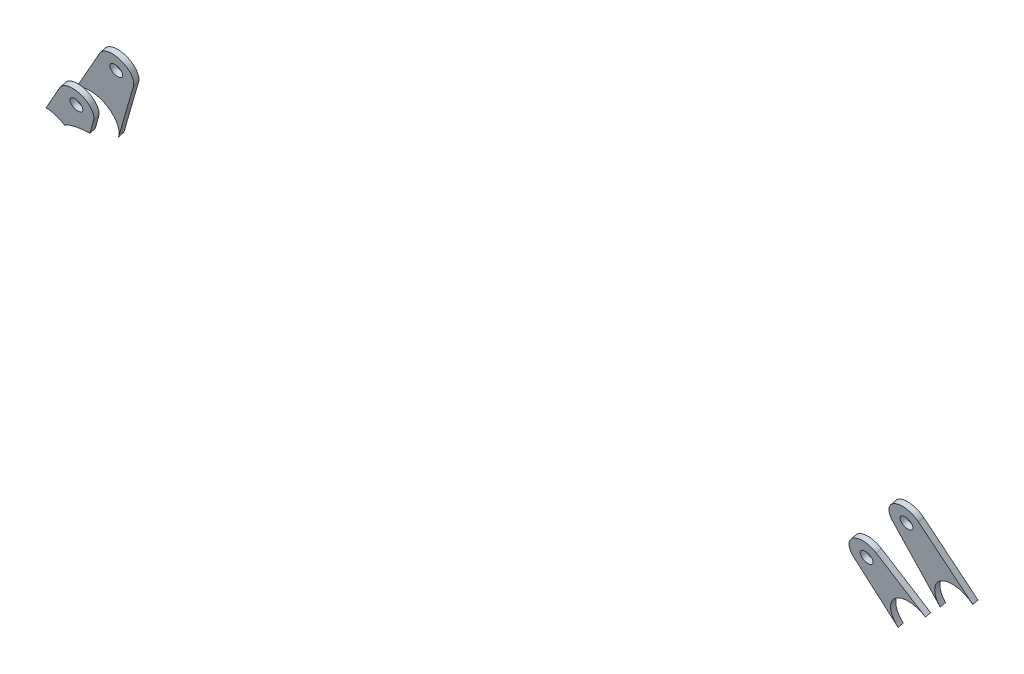
ISO-10303-21;
HEADER;
FILE_DESCRIPTION(('STEP AP214'),'2;1');
FILE_NAME('part.step','',(''),(''),'','','');
FILE_SCHEMA(('AUTOMOTIVE_DESIGN { 1 0 10303 214 1 1 1 1 }'));
ENDSEC;
DATA;
#1=APPLICATION_CONTEXT('core data for automotive mechanical design processes');
#2=APPLICATION_PROTOCOL_DEFINITION('international standard','automotive_design',2000,#1);
#3=PRODUCT_CONTEXT('',#1,'mechanical');
#4=PRODUCT('Part','Part','',(#3));
#5=PRODUCT_RELATED_PRODUCT_CATEGORY('part','',(#4));
#6=PRODUCT_DEFINITION_FORMATION('','',#4);
#7=PRODUCT_DEFINITION_CONTEXT('part definition',#1,'design');
#8=PRODUCT_DEFINITION('design','',#6,#7);
#9=PRODUCT_DEFINITION_SHAPE('','',#8);
#10=(LENGTH_UNIT() NAMED_UNIT(*) SI_UNIT(.MILLI.,.METRE.));
#11=(NAMED_UNIT(*) PLANE_ANGLE_UNIT() SI_UNIT($,.RADIAN.));
#12=(NAMED_UNIT(*) SI_UNIT($,.STERADIAN.) SOLID_ANGLE_UNIT());
#13=UNCERTAINTY_MEASURE_WITH_UNIT(LENGTH_MEASURE(1.E-05),#10,'distance_accuracy_value','');
#14=(GEOMETRIC_REPRESENTATION_CONTEXT(3) GLOBAL_UNCERTAINTY_ASSIGNED_CONTEXT((#13)) GLOBAL_UNIT_ASSIGNED_CONTEXT((#10,
#11,#12)) REPRESENTATION_CONTEXT('',''));
#15=CARTESIAN_POINT('',(0.,0.,0.));
#16=DIRECTION('',(0.,0.,1.));
#17=DIRECTION('',(1.,0.,0.));
#18=AXIS2_PLACEMENT_3D('',#15,#16,#17);
#19=CARTESIAN_POINT('',(-323.618752944138,84.6346554572961,266.700501514992));
#20=DIRECTION('',(0.912699556863011,-0.396326961660261,-0.0995211453069603));
#21=DIRECTION('',(0.398304364618356,0.917253309138739,0.));
#22=AXIS2_PLACEMENT_3D('',#19,#20,#21);
#23=PLANE('',#22);
#24=DIRECTION('',(0.408617382826522,0.887195361637097,0.214280714814993));
#25=VECTOR('',#24,1.);
#26=CARTESIAN_POINT('',(-323.60864452257,83.9259355071346,269.615568212695));
#27=LINE('',#26,#25);
#28=CARTESIAN_POINT('',(-255.599003552041,231.589350113444,305.280116746263));
#29=VERTEX_POINT('',#28);
#30=CARTESIAN_POINT('',(-251.285551049687,240.954774134955,307.54210980963));
#31=VERTEX_POINT('',#30);
#32=EDGE_CURVE('E138',#29,#31,#27,.T.);
#33=ORIENTED_EDGE('',*,*,#32,.F.);
#34=DIRECTION('',(0.00336947385613183,-0.236239983387161,0.9716888992343));
#35=VECTOR('',#34,1.);
#36=CARTESIAN_POINT('',(-255.609111973609,232.298070063605,302.36505004856));
#37=LINE('',#36,#35);
#38=CARTESIAN_POINT('',(-255.609111973609,232.298070063605,302.36505004856));
#39=VERTEX_POINT('',#38);
#40=EDGE_CURVE('E12',#39,#29,#37,.T.);
#41=ORIENTED_EDGE('',*,*,#40,.F.);
#42=DIRECTION('',(0.408617382826522,0.887195361637097,0.214280714814993));
#43=VECTOR('',#42,1.);
#44=CARTESIAN_POINT('',(-323.618752944138,84.6346554572961,266.700501514992));
#45=LINE('',#44,#43);
#46=CARTESIAN_POINT('',(-251.295659471255,241.663494085116,304.627043111927));
#47=VERTEX_POINT('',#46);
#48=EDGE_CURVE('E170',#39,#47,#45,.T.);
#49=ORIENTED_EDGE('',*,*,#48,.T.);
#50=DIRECTION('',(0.00336947385613183,-0.236239983387161,0.9716888992343));
#51=VECTOR('',#50,1.);
#52=CARTESIAN_POINT('',(-251.295659471255,241.663494085116,304.627043111927));
#53=LINE('',#52,#51);
#54=EDGE_CURVE('E89',#47,#31,#53,.T.);
#55=ORIENTED_EDGE('',*,*,#54,.T.);
#56=EDGE_LOOP('',(#33,#41,#49,#55));
#57=FACE_BOUND('',#56,.T.);
#58=ADVANCED_FACE('F47',(#57),#23,.T.);
#59=CARTESIAN_POINT('',(-267.768306548203,216.515355784536,298.57007197094));
#60=CARTESIAN_POINT('',(-244.725102094374,199.337784130967,294.313902408543));
#61=CARTESIAN_POINT('',(-204.568474804515,198.7676940574,294.03605136432));
#62=CARTESIAN_POINT('',(-208.929507414764,215.680041227753,298.162955564922));
#63=CARTESIAN_POINT('',(-213.290540025014,232.592388398106,302.289859765523));
#64=CARTESIAN_POINT('',(-255.476061824664,241.030653600877,304.487681152403));
#65=CARTESIAN_POINT('',(-270.741108911879,228.044062431943,301.383275094755));
#66=(BOUNDED_CURVE() B_SPLINE_CURVE(3,(#59,#60,#61,#62,#63,#64,#65),.UNSPECIFIED.,.F.,
.F.) B_SPLINE_CURVE_WITH_KNOTS((4,3,4),(0.,0.5,1.),
.UNSPECIFIED.) CURVE() GEOMETRIC_REPRESENTATION_ITEM() RATIONAL_B_SPLINE_CURVE((1.,
0.48841086436143,0.48841086436143,1.,0.48841086436143,0.48841086436143,1.)) REPRESENTATION_ITEM(''));
#67=DIRECTION('',(0.00336947385613183,-0.236239983387161,0.9716888992343));
#68=VECTOR('',#67,1.);
#69=SURFACE_OF_LINEAR_EXTRUSION('',#66,#68);
#70=CARTESIAN_POINT('',(-267.758198126635,215.806635834375,301.485138668643));
#71=CARTESIAN_POINT('',(-244.714993672805,198.629064180805,297.228969106246));
#72=CARTESIAN_POINT('',(-204.558366382947,198.058974107238,296.951118062023));
#73=CARTESIAN_POINT('',(-208.919398993196,214.971321277591,301.078022262625));
#74=CARTESIAN_POINT('',(-213.280431603445,231.883668447944,305.204926463226));
#75=CARTESIAN_POINT('',(-255.465953403095,240.321933650716,307.402747850106));
#76=CARTESIAN_POINT('',(-270.731000490311,227.335342481781,304.298341792458));
#77=(BOUNDED_CURVE() B_SPLINE_CURVE(3,(#70,#71,#72,#73,#74,#75,#76),.UNSPECIFIED.,.F.,
.F.) B_SPLINE_CURVE_WITH_KNOTS((4,3,4),(0.,0.5,1.),
.UNSPECIFIED.) CURVE() GEOMETRIC_REPRESENTATION_ITEM() RATIONAL_B_SPLINE_CURVE((1.,
0.48841086436143,0.48841086436143,1.,0.48841086436143,0.48841086436143,1.)) REPRESENTATION_ITEM(''));
#78=CARTESIAN_POINT('',(-270.731000490313,227.335342481788,304.298341792459));
#79=VERTEX_POINT('',#78);
#80=EDGE_CURVE('E130',#29,#79,#77,.T.);
#81=ORIENTED_EDGE('',*,*,#80,.T.);
#82=DIRECTION('',(0.00336947385613183,-0.236239983387161,0.9716888992343));
#83=VECTOR('',#82,1.);
#84=CARTESIAN_POINT('',(-270.741108911881,228.044062431949,301.383275094756));
#85=LINE('',#84,#83);
#86=CARTESIAN_POINT('',(-270.741108911881,228.044062431949,301.383275094756));
#87=VERTEX_POINT('',#86);
#88=EDGE_CURVE('E56',#87,#79,#85,.T.);
#89=ORIENTED_EDGE('',*,*,#88,.F.);
#90=EDGE_CURVE('E112',#39,#87,#66,.T.);
#91=ORIENTED_EDGE('',*,*,#90,.F.);
#92=ORIENTED_EDGE('',*,*,#40,.T.);
#93=EDGE_LOOP('',(#81,#89,#91,#92));
#94=FACE_BOUND('',#93,.T.);
#95=ADVANCED_FACE('F161',(#94),#69,.F.);
#96=CARTESIAN_POINT('',(-270.741108911881,228.044062431949,301.383275094756));
#97=CARTESIAN_POINT('',(-275.397420952184,233.48199443561,302.721508235956));
#98=CARTESIAN_POINT('',(-282.313406535008,234.096347828351,302.894853910728));
#99=CARTESIAN_POINT('',(-287.759062855812,229.555783012878,301.809821488515));
#100=(BOUNDED_CURVE() B_SPLINE_CURVE(3,(#96,#97,#98,#99),.UNSPECIFIED.,.F.,
.F.) B_SPLINE_CURVE_WITH_KNOTS((4,4),(0.,1.),
.UNSPECIFIED.) CURVE() GEOMETRIC_REPRESENTATION_ITEM() RATIONAL_B_SPLINE_CURVE((1.,
0.820223126076394,0.820223126076394,1.)) REPRESENTATION_ITEM(''));
#101=DIRECTION('',(0.00336947385613183,-0.236239983387161,0.9716888992343));
#102=VECTOR('',#101,1.);
#103=SURFACE_OF_LINEAR_EXTRUSION('',#100,#102);
#104=CARTESIAN_POINT('',(-270.731000490313,227.335342481788,304.298341792459));
#105=CARTESIAN_POINT('',(-275.387312530615,232.773274485448,305.636574933659));
#106=CARTESIAN_POINT('',(-282.30329811344,233.387627878189,305.80992060843));
#107=CARTESIAN_POINT('',(-287.748954434244,228.847063062717,304.724888186218));
#108=(BOUNDED_CURVE() B_SPLINE_CURVE(3,(#104,#105,#106,#107),.UNSPECIFIED.,.F.,
.F.) B_SPLINE_CURVE_WITH_KNOTS((4,4),(0.,1.),
.UNSPECIFIED.) CURVE() GEOMETRIC_REPRESENTATION_ITEM() RATIONAL_B_SPLINE_CURVE((1.,
0.820223126076394,0.820223126076394,1.)) REPRESENTATION_ITEM(''));
#109=CARTESIAN_POINT('',(-280.018977938609,231.685199389689,305.388099760963));
#110=VERTEX_POINT('',#109);
#111=EDGE_CURVE('E118',#79,#110,#108,.T.);
#112=ORIENTED_EDGE('',*,*,#111,.T.);
#113=DIRECTION('',(0.00336947385613183,-0.236239983387161,0.9716888992343));
#114=VECTOR('',#113,1.);
#115=CARTESIAN_POINT('',(-280.029086360177,232.393919339851,302.473033063261));
#116=LINE('',#115,#114);
#117=CARTESIAN_POINT('',(-280.029086360177,232.393919339851,302.473033063261));
#118=VERTEX_POINT('',#117);
#119=EDGE_CURVE('E105',#118,#110,#116,.T.);
#120=ORIENTED_EDGE('',*,*,#119,.F.);
#121=EDGE_CURVE('E108',#87,#118,#100,.T.);
#122=ORIENTED_EDGE('',*,*,#121,.F.);
#123=ORIENTED_EDGE('',*,*,#88,.T.);
#124=EDGE_LOOP('',(#112,#120,#122,#123));
#125=FACE_BOUND('',#124,.T.);
#126=ADVANCED_FACE('F117',(#125),#103,.F.);
#127=CARTESIAN_POINT('',(-332.332049830405,154.316606864709,283.672005750479));
#128=DIRECTION('',(0.837949841349879,-0.529625440788603,-0.131669874501309));
#129=DIRECTION('',(0.534277059055671,0.845309425102325,0.));
#130=AXIS2_PLACEMENT_3D('',#127,#128,#129);
#131=PLANE('',#130);
#132=DIRECTION('',(0.545736850531138,0.814670217154593,0.19617269752349));
#133=VECTOR('',#132,1.);
#134=CARTESIAN_POINT('',(-332.321941408837,153.607886914547,286.587072448182));
#135=LINE('',#134,#133);
#136=CARTESIAN_POINT('',(-267.916720332709,249.751321958219,309.738424497809));
#137=VERTEX_POINT('',#136);
#138=EDGE_CURVE('E125',#110,#137,#135,.T.);
#139=ORIENTED_EDGE('',*,*,#138,.T.);
#140=DIRECTION('',(0.00336947385613183,-0.236239983387161,0.9716888992343));
#141=VECTOR('',#140,1.);
#142=CARTESIAN_POINT('',(-267.926828754278,250.460041908381,306.823357800106));
#143=LINE('',#142,#141);
#144=CARTESIAN_POINT('',(-267.926828754278,250.460041908381,306.823357800106));
#145=VERTEX_POINT('',#144);
#146=EDGE_CURVE('E107',#145,#137,#143,.T.);
#147=ORIENTED_EDGE('',*,*,#146,.F.);
#148=DIRECTION('',(0.545736850531138,0.814670217154593,0.19617269752349));
#149=VECTOR('',#148,1.);
#150=CARTESIAN_POINT('',(-332.332049830405,154.316606864709,283.672005750479));
#151=LINE('',#150,#149);
#152=EDGE_CURVE('E100',#118,#145,#151,.T.);
#153=ORIENTED_EDGE('',*,*,#152,.F.);
#154=ORIENTED_EDGE('',*,*,#119,.T.);
#155=EDGE_LOOP('',(#139,#147,#153,#154));
#156=FACE_BOUND('',#155,.T.);
#157=ADVANCED_FACE('F103',(#156),#131,.F.);
#158=CARTESIAN_POINT('',(-259.966305261454,245.428600220889,305.572493992343));
#159=DIRECTION('',(0.00336947385613183,-0.236239983387161,0.9716888992343));
#160=DIRECTION('',(0.,-0.971694415245328,-0.236241324456668));
#161=AXIS2_PLACEMENT_3D('',#158,#159,#160);
#162=CYLINDRICAL_SURFACE('',#161,3.50000000000014);
#163=CARTESIAN_POINT('',(-259.966305261454,245.428600220889,305.572493992343));
#164=DIRECTION('',(-0.00336947385613179,0.236239983387161,-0.971688899234301));
#165=DIRECTION('',(0.,0.971694415245328,0.236241324456668));
#166=AXIS2_PLACEMENT_3D('',#163,#164,#165);
#167=CIRCLE('',#166,3.50000000000014);
#168=CARTESIAN_POINT('',(-259.966305261454,248.829530674247,306.399338627942));
#169=VERTEX_POINT('',#168);
#170=EDGE_CURVE('E124',#169,#169,#167,.T.);
#171=ORIENTED_EDGE('',*,*,#170,.T.);
#172=EDGE_LOOP('',(#171));
#173=FACE_BOUND('',#172,.T.);
#174=CARTESIAN_POINT('',(-259.956196839885,244.719880270727,308.487560690046));
#175=DIRECTION('',(-0.00336947385613179,0.236239983387161,-0.971688899234301));
#176=DIRECTION('',(0.,0.971694415245328,0.236241324456668));
#177=AXIS2_PLACEMENT_3D('',#174,#175,#176);
#178=CIRCLE('',#177,3.50000000000014);
#179=CARTESIAN_POINT('',(-259.956196839885,248.120810724086,309.314405325644));
#180=VERTEX_POINT('',#179);
#181=EDGE_CURVE('E143',#180,#180,#178,.T.);
#182=ORIENTED_EDGE('',*,*,#181,.F.);
#183=EDGE_LOOP('',(#182));
#184=FACE_BOUND('',#183,.T.);
#185=ADVANCED_FACE('F49',(#173,#184),#162,.F.);
#186=CARTESIAN_POINT('',(-259.966305261454,245.428600220889,305.572493992343));
#187=DIRECTION('',(0.00336947385613183,-0.236239983387161,0.9716888992343));
#188=DIRECTION('',(0.,-0.971694415245328,-0.236241324456668));
#189=AXIS2_PLACEMENT_3D('',#186,#187,#188);
#190=CYLINDRICAL_SURFACE('',#189,9.50000000000005);
#191=CARTESIAN_POINT('',(-259.956196839885,244.719880270727,308.487560690046));
#192=DIRECTION('',(-0.00336947385613179,0.236239983387161,-0.971688899234301));
#193=DIRECTION('',(0.,0.971694415245328,0.236241324456668));
#194=AXIS2_PLACEMENT_3D('',#191,#192,#193);
#195=CIRCLE('',#194,9.50000000000005);
#196=EDGE_CURVE('E82',#137,#31,#195,.T.);
#197=ORIENTED_EDGE('',*,*,#196,.T.);
#198=ORIENTED_EDGE('',*,*,#54,.F.);
#199=CARTESIAN_POINT('',(-259.966305261454,245.428600220889,305.572493992343));
#200=DIRECTION('',(-0.00336947385613179,0.236239983387161,-0.971688899234301));
#201=DIRECTION('',(0.,0.971694415245328,0.236241324456668));
#202=AXIS2_PLACEMENT_3D('',#199,#200,#201);
#203=CIRCLE('',#202,9.50000000000005);
#204=EDGE_CURVE('E64',#145,#47,#203,.T.);
#205=ORIENTED_EDGE('',*,*,#204,.F.);
#206=ORIENTED_EDGE('',*,*,#146,.T.);
#207=EDGE_LOOP('',(#197,#198,#205,#206));
#208=FACE_BOUND('',#207,.T.);
#209=ADVANCED_FACE('F178',(#208),#190,.T.);
#210=CARTESIAN_POINT('',(0.802155148815398,-56.2405666645017,231.325508624773));
#211=DIRECTION('',(-0.00336947385613179,0.236239983387161,-0.971688899234301));
#212=DIRECTION('',(0.,0.971694415245328,0.236241324456668));
#213=AXIS2_PLACEMENT_3D('',#210,#211,#212);
#214=PLANE('',#213);
#215=ORIENTED_EDGE('',*,*,#170,.F.);
#216=EDGE_LOOP('',(#215));
#217=FACE_BOUND('',#216,.T.);
#218=ORIENTED_EDGE('',*,*,#48,.F.);
#219=ORIENTED_EDGE('',*,*,#90,.T.);
#220=ORIENTED_EDGE('',*,*,#121,.T.);
#221=ORIENTED_EDGE('',*,*,#152,.T.);
#222=ORIENTED_EDGE('',*,*,#204,.T.);
#223=EDGE_LOOP('',(#218,#219,#220,#221,#222));
#224=FACE_BOUND('',#223,.T.);
#225=ADVANCED_FACE('F111',(#217,#224),#214,.T.);
#226=CARTESIAN_POINT('',(0.812263570383794,-56.9492866146632,234.240575322476));
#227=DIRECTION('',(-0.00336947385613179,0.236239983387161,-0.971688899234301));
#228=DIRECTION('',(0.,0.971694415245328,0.236241324456668));
#229=AXIS2_PLACEMENT_3D('',#226,#227,#228);
#230=PLANE('',#229);
#231=ORIENTED_EDGE('',*,*,#181,.T.);
#232=EDGE_LOOP('',(#231));
#233=FACE_BOUND('',#232,.T.);
#234=ORIENTED_EDGE('',*,*,#32,.T.);
#235=ORIENTED_EDGE('',*,*,#196,.F.);
#236=ORIENTED_EDGE('',*,*,#138,.F.);
#237=ORIENTED_EDGE('',*,*,#111,.F.);
#238=ORIENTED_EDGE('',*,*,#80,.F.);
#239=EDGE_LOOP('',(#234,#235,#236,#237,#238));
#240=FACE_BOUND('',#239,.T.);
#241=ADVANCED_FACE('F169',(#233,#240),#230,.F.);
#242=CLOSED_SHELL('',(#58,#95,#126,#157,#185,#209,#225,#241));
#243=MANIFOLD_SOLID_BREP('B2',#242);
#244=CARTESIAN_POINT('',(259.189959811541,176.321590448709,286.97073542829));
#245=DIRECTION('',(-0.733932457577158,-0.660576514949453,-0.158056368463876));
#246=DIRECTION('',(0.668985603179699,-0.743275361315236,0.));
#247=AXIS2_PLACEMENT_3D('',#244,#245,#246);
#248=PLANE('',#247);
#249=DIRECTION('',(0.679214100531406,-0.712621455014139,-0.175609986882423));
#250=VECTOR('',#249,1.);
#251=CARTESIAN_POINT('',(259.20006823311,175.612870498547,289.885802125993));
#252=LINE('',#251,#250);
#253=CARTESIAN_POINT('',(187.01616150711,251.347164882955,308.548864190454));
#254=VERTEX_POINT('',#253);
#255=CARTESIAN_POINT('',(208.816866377583,228.474185636831,302.912318227501));
#256=VERTEX_POINT('',#255);
#257=EDGE_CURVE('E318',#254,#256,#252,.T.);
#258=ORIENTED_EDGE('',*,*,#257,.T.);
#259=DIRECTION('',(0.00336947385613183,-0.236239983387161,0.9716888992343));
#260=VECTOR('',#259,1.);
#261=CARTESIAN_POINT('',(208.806757956015,229.182905586992,299.997251529798));
#262=LINE('',#261,#260);
#263=CARTESIAN_POINT('',(208.806757956015,229.182905586992,299.997251529798));
#264=VERTEX_POINT('',#263);
#265=EDGE_CURVE('E45',#264,#256,#262,.T.);
#266=ORIENTED_EDGE('',*,*,#265,.F.);
#267=DIRECTION('',(0.679214100531406,-0.712621455014139,-0.175609986882423));
#268=VECTOR('',#267,1.);
#269=CARTESIAN_POINT('',(259.189959811541,176.321590448709,286.97073542829));
#270=LINE('',#269,#268);
#271=CARTESIAN_POINT('',(187.006053085542,252.055884833117,305.633797492752));
#272=VERTEX_POINT('',#271);
#273=EDGE_CURVE('E297',#272,#264,#270,.T.);
#274=ORIENTED_EDGE('',*,*,#273,.F.);
#275=DIRECTION('',(0.00336947385613183,-0.236239983387161,0.9716888992343));
#276=VECTOR('',#275,1.);
#277=CARTESIAN_POINT('',(187.006053085542,252.055884833117,305.633797492752));
#278=LINE('',#277,#276);
#279=EDGE_CURVE('E308',#272,#254,#278,.T.);
#280=ORIENTED_EDGE('',*,*,#279,.T.);
#281=EDGE_LOOP('',(#258,#266,#274,#280));
#282=FACE_BOUND('',#281,.T.);
#283=ADVANCED_FACE('F249',(#282),#248,.F.);
#284=CARTESIAN_POINT('',(199.892236479848,233.02101043087,300.961295754599));
#285=CARTESIAN_POINT('',(174.893160796666,232.808922583749,300.996420270777));
#286=CARTESIAN_POINT('',(175.108137508272,206.406117271777,294.576543856011));
#287=CARTESIAN_POINT('',(200.107213191454,206.618205118897,294.541419339833));
#288=CARTESIAN_POINT('',(225.106288874636,206.830292966017,294.506294823654));
#289=CARTESIAN_POINT('',(224.89131216303,233.23309827799,300.92617123842));
#290=CARTESIAN_POINT('',(199.892236479848,233.02101043087,300.961295754599));
#291=(BOUNDED_CURVE() B_SPLINE_CURVE(3,(#284,#285,#286,#287,#288,#289,#290),.UNSPECIFIED.,.T.,
.F.) B_SPLINE_CURVE_WITH_KNOTS((4,3,4),(0.,0.5,1.),
.UNSPECIFIED.) CURVE() GEOMETRIC_REPRESENTATION_ITEM() RATIONAL_B_SPLINE_CURVE((1.,
0.333333333333333,0.333333333333333,1.,0.333333333333333,0.333333333333333,1.)) REPRESENTATION_ITEM(''));
#292=DIRECTION('',(0.00336947385613183,-0.236239983387161,0.9716888992343));
#293=VECTOR('',#292,1.);
#294=SURFACE_OF_LINEAR_EXTRUSION('',#291,#293);
#295=CARTESIAN_POINT('',(199.902344901417,232.312290480708,303.876362452302));
#296=CARTESIAN_POINT('',(174.903269218234,232.100202633588,303.91148696848));
#297=CARTESIAN_POINT('',(175.11824592984,205.697397321615,297.491610553714));
#298=CARTESIAN_POINT('',(200.117321613023,205.909485168736,297.456486037536));
#299=CARTESIAN_POINT('',(225.116397296205,206.121573015856,297.421361521357));
#300=CARTESIAN_POINT('',(224.901420584599,232.524378327828,303.841237936123));
#301=CARTESIAN_POINT('',(199.902344901417,232.312290480708,303.876362452302));
#302=(BOUNDED_CURVE() B_SPLINE_CURVE(3,(#295,#296,#297,#298,#299,#300,#301),.UNSPECIFIED.,.T.,
.F.) B_SPLINE_CURVE_WITH_KNOTS((4,3,4),(0.,0.5,1.),
.UNSPECIFIED.) CURVE() GEOMETRIC_REPRESENTATION_ITEM() RATIONAL_B_SPLINE_CURVE((1.,
0.333333333333333,0.333333333333333,1.,0.333333333333333,0.333333333333333,1.)) REPRESENTATION_ITEM(''));
#303=CARTESIAN_POINT('',(189.558411513671,211.87519909172,298.943503261594));
#304=VERTEX_POINT('',#303);
#305=EDGE_CURVE('E302',#256,#304,#302,.T.);
#306=ORIENTED_EDGE('',*,*,#305,.T.);
#307=DIRECTION('',(0.00336947385613183,-0.236239983387161,0.9716888992343));
#308=VECTOR('',#307,1.);
#309=CARTESIAN_POINT('',(189.548303092102,212.583919041882,296.028436563891));
#310=LINE('',#309,#308);
#311=CARTESIAN_POINT('',(189.548303092102,212.583919041882,296.028436563891));
#312=VERTEX_POINT('',#311);
#313=EDGE_CURVE('E258',#312,#304,#310,.T.);
#314=ORIENTED_EDGE('',*,*,#313,.F.);
#315=EDGE_CURVE('E292',#264,#312,#291,.T.);
#316=ORIENTED_EDGE('',*,*,#315,.F.);
#317=ORIENTED_EDGE('',*,*,#265,.T.);
#318=EDGE_LOOP('',(#306,#314,#316,#317));
#319=FACE_BOUND('',#318,.T.);
#320=ADVANCED_FACE('F301',(#319),#294,.F.);
#321=CARTESIAN_POINT('',(261.486445654151,96.7358160243039,267.613634619888));
#322=DIRECTION('',(-0.856315479423987,-0.502508395226948,-0.119201981633294));
#323=DIRECTION('',(0.506116996496215,-0.862464831664254,0.));
#324=AXIS2_PLACEMENT_3D('',#321,#322,#323);
#325=PLANE('',#324);
#326=DIRECTION('',(0.516442103574834,-0.831670597638074,-0.203989143533496));
#327=VECTOR('',#326,1.);
#328=CARTESIAN_POINT('',(261.496554075719,96.0270960741424,270.528701317591));
#329=LINE('',#328,#327);
#330=CARTESIAN_POINT('',(171.908806105599,240.29785823628,305.914909864531));
#331=VERTEX_POINT('',#330);
#332=EDGE_CURVE('E324',#331,#304,#329,.T.);
#333=ORIENTED_EDGE('',*,*,#332,.F.);
#334=DIRECTION('',(0.00336947385613183,-0.236239983387161,0.9716888992343));
#335=VECTOR('',#334,1.);
#336=CARTESIAN_POINT('',(171.898697684031,241.006578186441,302.999843166828));
#337=LINE('',#336,#335);
#338=CARTESIAN_POINT('',(171.898697684031,241.006578186441,302.999843166828));
#339=VERTEX_POINT('',#338);
#340=EDGE_CURVE('E282',#339,#331,#337,.T.);
#341=ORIENTED_EDGE('',*,*,#340,.F.);
#342=DIRECTION('',(0.516442103574834,-0.831670597638074,-0.203989143533496));
#343=VECTOR('',#342,1.);
#344=CARTESIAN_POINT('',(261.486445654151,96.7358160243039,267.613634619888));
#345=LINE('',#344,#343);
#346=EDGE_CURVE('E295',#339,#312,#345,.T.);
#347=ORIENTED_EDGE('',*,*,#346,.T.);
#348=ORIENTED_EDGE('',*,*,#313,.T.);
#349=EDGE_LOOP('',(#333,#341,#347,#348));
#350=FACE_BOUND('',#349,.T.);
#351=ADVANCED_FACE('F306',(#350),#325,.T.);
#352=CARTESIAN_POINT('',(180.033694738559,245.780407941097,304.132261992345));
#353=DIRECTION('',(0.00336947385613183,-0.236239983387161,0.9716888992343));
#354=DIRECTION('',(0.,-0.971694415245328,-0.236241324456668));
#355=AXIS2_PLACEMENT_3D('',#352,#353,#354);
#356=CYLINDRICAL_SURFACE('',#355,3.50000000000002);
#357=CARTESIAN_POINT('',(180.033694738559,245.780407941097,304.132261992345));
#358=DIRECTION('',(-0.00336947385613179,0.236239983387161,-0.971688899234301));
#359=DIRECTION('',(0.,0.971694415245328,0.236241324456668));
#360=AXIS2_PLACEMENT_3D('',#357,#358,#359);
#361=CIRCLE('',#360,3.50000000000002);
#362=CARTESIAN_POINT('',(180.033694738559,249.181338394456,304.959106627943));
#363=VERTEX_POINT('',#362);
#364=EDGE_CURVE('E330',#363,#363,#361,.T.);
#365=ORIENTED_EDGE('',*,*,#364,.T.);
#366=EDGE_LOOP('',(#365));
#367=FACE_BOUND('',#366,.T.);
#368=CARTESIAN_POINT('',(180.043803160127,245.071687990936,307.047328690048));
#369=DIRECTION('',(-0.00336947385613179,0.236239983387161,-0.971688899234301));
#370=DIRECTION('',(0.,0.971694415245328,0.236241324456668));
#371=AXIS2_PLACEMENT_3D('',#368,#369,#370);
#372=CIRCLE('',#371,3.50000000000002);
#373=CARTESIAN_POINT('',(180.043803160127,248.472618444294,307.874173325646));
#374=VERTEX_POINT('',#373);
#375=EDGE_CURVE('E315',#374,#374,#372,.T.);
#376=ORIENTED_EDGE('',*,*,#375,.F.);
#377=EDGE_LOOP('',(#376));
#378=FACE_BOUND('',#377,.T.);
#379=ADVANCED_FACE('F251',(#367,#378),#356,.F.);
#380=CARTESIAN_POINT('',(180.033694738559,245.780407941097,304.132261992345));
#381=DIRECTION('',(0.00336947385613183,-0.236239983387161,0.9716888992343));
#382=DIRECTION('',(0.,-0.971694415245328,-0.236241324456668));
#383=AXIS2_PLACEMENT_3D('',#380,#381,#382);
#384=CYLINDRICAL_SURFACE('',#383,9.49999999999997);
#385=CARTESIAN_POINT('',(180.043803160127,245.071687990936,307.047328690048));
#386=DIRECTION('',(-0.00336947385613179,0.236239983387161,-0.971688899234301));
#387=DIRECTION('',(0.,0.971694415245328,0.236241324456668));
#388=AXIS2_PLACEMENT_3D('',#385,#386,#387);
#389=CIRCLE('',#388,9.49999999999997);
#390=EDGE_CURVE('E285',#331,#254,#389,.T.);
#391=ORIENTED_EDGE('',*,*,#390,.T.);
#392=ORIENTED_EDGE('',*,*,#279,.F.);
#393=CARTESIAN_POINT('',(180.033694738559,245.780407941097,304.132261992345));
#394=DIRECTION('',(-0.00336947385613179,0.236239983387161,-0.971688899234301));
#395=DIRECTION('',(0.,0.971694415245328,0.236241324456668));
#396=AXIS2_PLACEMENT_3D('',#393,#394,#395);
#397=CIRCLE('',#396,9.49999999999997);
#398=EDGE_CURVE('E266',#339,#272,#397,.T.);
#399=ORIENTED_EDGE('',*,*,#398,.F.);
#400=ORIENTED_EDGE('',*,*,#340,.T.);
#401=EDGE_LOOP('',(#391,#392,#399,#400));
#402=FACE_BOUND('',#401,.T.);
#403=ADVANCED_FACE('F342',(#402),#384,.T.);
#404=CARTESIAN_POINT('',(0.802155148815398,-56.2405666645017,231.325508624773));
#405=DIRECTION('',(-0.00336947385613179,0.236239983387161,-0.971688899234301));
#406=DIRECTION('',(0.,0.971694415245328,0.236241324456668));
#407=AXIS2_PLACEMENT_3D('',#404,#405,#406);
#408=PLANE('',#407);
#409=ORIENTED_EDGE('',*,*,#364,.F.);
#410=EDGE_LOOP('',(#409));
#411=FACE_BOUND('',#410,.T.);
#412=ORIENTED_EDGE('',*,*,#273,.T.);
#413=ORIENTED_EDGE('',*,*,#315,.T.);
#414=ORIENTED_EDGE('',*,*,#346,.F.);
#415=ORIENTED_EDGE('',*,*,#398,.T.);
#416=EDGE_LOOP('',(#412,#413,#414,#415));
#417=FACE_BOUND('',#416,.T.);
#418=ADVANCED_FACE('F293',(#411,#417),#408,.T.);
#419=CARTESIAN_POINT('',(0.812263570383794,-56.9492866146632,234.240575322476));
#420=DIRECTION('',(-0.00336947385613179,0.236239983387161,-0.971688899234301));
#421=DIRECTION('',(0.,0.971694415245328,0.236241324456668));
#422=AXIS2_PLACEMENT_3D('',#419,#420,#421);
#423=PLANE('',#422);
#424=ORIENTED_EDGE('',*,*,#375,.T.);
#425=EDGE_LOOP('',(#424));
#426=FACE_BOUND('',#425,.T.);
#427=ORIENTED_EDGE('',*,*,#257,.F.);
#428=ORIENTED_EDGE('',*,*,#390,.F.);
#429=ORIENTED_EDGE('',*,*,#332,.T.);
#430=ORIENTED_EDGE('',*,*,#305,.F.);
#431=EDGE_LOOP('',(#427,#428,#429,#430));
#432=FACE_BOUND('',#431,.T.);
#433=ADVANCED_FACE('F335',(#426,#432),#423,.F.);
#434=CLOSED_SHELL('',(#283,#320,#351,#379,#403,#418,#433));
#435=MANIFOLD_SOLID_BREP('B6',#434);
#436=CARTESIAN_POINT('',(-323.696250842771,90.0681750718898,244.351656831798));
#437=DIRECTION('',(-0.912699556866559,0.396326961652558,0.0995211453050996));
#438=DIRECTION('',(-0.39830436461054,-0.917253309142133,0.));
#439=AXIS2_PLACEMENT_3D('',#436,#437,#438);
#440=PLANE('',#439);
#441=DIRECTION('',(-0.408617382818597,-0.887195361640539,-0.214280714815857));
#442=VECTOR('',#441,1.);
#443=CARTESIAN_POINT('',(-323.686142421203,89.3594551217283,247.2667235295));
#444=LINE('',#443,#442);
#445=CARTESIAN_POINT('',(-251.363048948428,246.388293752969,285.193265127268));
#446=VERTEX_POINT('',#445);
#447=CARTESIAN_POINT('',(-268.75872515476,208.618575939202,276.070897629131));
#448=VERTEX_POINT('',#447);
#449=EDGE_CURVE('E482',#446,#448,#444,.T.);
#450=ORIENTED_EDGE('',*,*,#449,.T.);
#451=DIRECTION('',(0.00336947385613183,-0.236239983387161,0.9716888992343));
#452=VECTOR('',#451,1.);
#453=CARTESIAN_POINT('',(-268.768833576328,209.327295889363,273.155830931428));
#454=LINE('',#453,#452);
#455=CARTESIAN_POINT('',(-268.768833576328,209.327295889363,273.155830931428));
#456=VERTEX_POINT('',#455);
#457=EDGE_CURVE('E247',#456,#448,#454,.T.);
#458=ORIENTED_EDGE('',*,*,#457,.F.);
#459=DIRECTION('',(-0.408617382818597,-0.887195361640539,-0.214280714815857));
#460=VECTOR('',#459,1.);
#461=CARTESIAN_POINT('',(-323.696250842771,90.0681750718898,244.351656831798));
#462=LINE('',#461,#460);
#463=CARTESIAN_POINT('',(-251.373157369996,247.09701370313,282.278198429565));
#464=VERTEX_POINT('',#463);
#465=EDGE_CURVE('E461',#464,#456,#462,.T.);
#466=ORIENTED_EDGE('',*,*,#465,.F.);
#467=DIRECTION('',(0.00336947385613183,-0.236239983387161,0.9716888992343));
#468=VECTOR('',#467,1.);
#469=CARTESIAN_POINT('',(-251.373157369996,247.09701370313,282.278198429565));
#470=LINE('',#469,#468);
#471=EDGE_CURVE('E472',#464,#446,#470,.T.);
#472=ORIENTED_EDGE('',*,*,#471,.T.);
#473=EDGE_LOOP('',(#450,#458,#466,#472));
#474=FACE_BOUND('',#473,.T.);
#475=ADVANCED_FACE('F413',(#474),#440,.F.);
#476=CARTESIAN_POINT('',(-268.768833576328,209.327295889363,273.155830931428));
#477=CARTESIAN_POINT('',(-263.547422742714,220.664090816804,275.893961252895));
#478=CARTESIAN_POINT('',(-271.373996265816,228.383135011305,277.797778728427));
#479=CARTESIAN_POINT('',(-280.117596777373,228.308955812358,277.810063772143));
#480=CARTESIAN_POINT('',(-283.763039329078,228.278028506389,277.815185737751));
#481=CARTESIAN_POINT('',(-287.607808230524,226.629690892976,277.427769145455));
#482=CARTESIAN_POINT('',(-290.215795546232,222.736514922256,276.490291849701));
#483=(BOUNDED_CURVE() B_SPLINE_CURVE(3,(#476,#477,#478,#479,#480,#481,#482),.UNSPECIFIED.,.F.,
.F.) B_SPLINE_CURVE_WITH_KNOTS((4,3,4),(0.191302656196466,0.5,0.669345632337475),
.UNSPECIFIED.) CURVE() GEOMETRIC_REPRESENTATION_ITEM() RATIONAL_B_SPLINE_CURVE((0.527563025356723,
0.430924550047528,0.588403541595288,1.,0.774205823550034,0.624886162278145,0.552041016184334)) REPRESENTATION_ITEM(''));
#484=DIRECTION('',(0.00336947385613183,-0.236239983387161,0.9716888992343));
#485=VECTOR('',#484,1.);
#486=SURFACE_OF_LINEAR_EXTRUSION('',#483,#485);
#487=CARTESIAN_POINT('',(-268.75872515476,208.618575939202,276.070897629131));
#488=CARTESIAN_POINT('',(-263.537314321145,219.955370866643,278.809027950598));
#489=CARTESIAN_POINT('',(-271.363887844247,227.674415061143,280.71284542613));
#490=CARTESIAN_POINT('',(-280.107488355804,227.600235862197,280.725130469846));
#491=CARTESIAN_POINT('',(-283.75293090751,227.569308556228,280.730252435454));
#492=CARTESIAN_POINT('',(-287.597699808956,225.920970942815,280.342835843158));
#493=CARTESIAN_POINT('',(-290.205687124664,222.027794972094,279.405358547404));
#494=(BOUNDED_CURVE() B_SPLINE_CURVE(3,(#487,#488,#489,#490,#491,#492,#493),.UNSPECIFIED.,.F.,
.F.) B_SPLINE_CURVE_WITH_KNOTS((4,3,4),(0.191302656196466,0.5,0.669345632337475),
.UNSPECIFIED.) CURVE() GEOMETRIC_REPRESENTATION_ITEM() RATIONAL_B_SPLINE_CURVE((0.527563025356723,
0.430924550047528,0.588403541595288,1.,0.774205823550034,0.624886162278145,0.552041016184334)) REPRESENTATION_ITEM(''));
#495=CARTESIAN_POINT('',(-290.205687124664,222.027794972094,279.405358547404));
#496=VERTEX_POINT('',#495);
#497=EDGE_CURVE('E466',#448,#496,#494,.T.);
#498=ORIENTED_EDGE('',*,*,#497,.T.);
#499=DIRECTION('',(0.00336947385613183,-0.236239983387161,0.9716888992343));
#500=VECTOR('',#499,1.);
#501=CARTESIAN_POINT('',(-290.215795546232,222.736514922256,276.490291849701));
#502=LINE('',#501,#500);
#503=CARTESIAN_POINT('',(-290.215795546232,222.736514922256,276.490291849701));
#504=VERTEX_POINT('',#503);
#505=EDGE_CURVE('E422',#504,#496,#502,.T.);
#506=ORIENTED_EDGE('',*,*,#505,.F.);
#507=EDGE_CURVE('E456',#456,#504,#483,.T.);
#508=ORIENTED_EDGE('',*,*,#507,.F.);
#509=ORIENTED_EDGE('',*,*,#457,.T.);
#510=EDGE_LOOP('',(#498,#506,#508,#509));
#511=FACE_BOUND('',#510,.T.);
#512=ADVANCED_FACE('F465',(#511),#486,.F.);
#513=CARTESIAN_POINT('',(-332.409547729097,159.750126482614,261.32316106809));
#514=DIRECTION('',(-0.837949841349879,0.529625440788603,0.131669874501309));
#515=DIRECTION('',(-0.534277059055671,-0.845309425102325,0.));
#516=AXIS2_PLACEMENT_3D('',#513,#514,#515);
#517=PLANE('',#516);
#518=DIRECTION('',(-0.545736850531138,-0.814670217154593,-0.19617269752349));
#519=VECTOR('',#518,1.);
#520=CARTESIAN_POINT('',(-332.399439307528,159.041406532452,264.238227765793));
#521=LINE('',#520,#519);
#522=CARTESIAN_POINT('',(-267.994218231401,255.184841576124,287.38957981542));
#523=VERTEX_POINT('',#522);
#524=EDGE_CURVE('E488',#523,#496,#521,.T.);
#525=ORIENTED_EDGE('',*,*,#524,.F.);
#526=DIRECTION('',(0.00336947385613183,-0.236239983387161,0.9716888992343));
#527=VECTOR('',#526,1.);
#528=CARTESIAN_POINT('',(-268.004326652969,255.893561526285,284.474513117717));
#529=LINE('',#528,#527);
#530=CARTESIAN_POINT('',(-268.004326652969,255.893561526285,284.474513117717));
#531=VERTEX_POINT('',#530);
#532=EDGE_CURVE('E446',#531,#523,#529,.T.);
#533=ORIENTED_EDGE('',*,*,#532,.F.);
#534=DIRECTION('',(-0.545736850531138,-0.814670217154593,-0.19617269752349));
#535=VECTOR('',#534,1.);
#536=CARTESIAN_POINT('',(-332.409547729097,159.750126482614,261.32316106809));
#537=LINE('',#536,#535);
#538=EDGE_CURVE('E459',#531,#504,#537,.T.);
#539=ORIENTED_EDGE('',*,*,#538,.T.);
#540=ORIENTED_EDGE('',*,*,#505,.T.);
#541=EDGE_LOOP('',(#525,#533,#539,#540));
#542=FACE_BOUND('',#541,.T.);
#543=ADVANCED_FACE('F470',(#542),#517,.T.);
#544=CARTESIAN_POINT('',(-260.043803160145,250.862119838793,283.223649309954));
#545=DIRECTION('',(0.00336947385613183,-0.236239983387161,0.9716888992343));
#546=DIRECTION('',(0.,-0.971694415245328,-0.236241324456668));
#547=AXIS2_PLACEMENT_3D('',#544,#545,#546);
#548=CYLINDRICAL_SURFACE('',#547,3.50000000000007);
#549=CARTESIAN_POINT('',(-260.043803160145,250.862119838793,283.223649309954));
#550=DIRECTION('',(-0.00336947385613187,0.236239983387161,-0.971688899234301));
#551=DIRECTION('',(0.,0.971694415245328,0.236241324456668));
#552=AXIS2_PLACEMENT_3D('',#549,#550,#551);
#553=CIRCLE('',#552,3.50000000000007);
#554=CARTESIAN_POINT('',(-260.043803160145,254.263050292152,284.050493945553));
#555=VERTEX_POINT('',#554);
#556=EDGE_CURVE('E494',#555,#555,#553,.T.);
#557=ORIENTED_EDGE('',*,*,#556,.T.);
#558=EDGE_LOOP('',(#557));
#559=FACE_BOUND('',#558,.T.);
#560=CARTESIAN_POINT('',(-260.033694738576,250.153399888632,286.138716007657));
#561=DIRECTION('',(-0.00336947385613187,0.236239983387161,-0.971688899234301));
#562=DIRECTION('',(0.,0.971694415245328,0.236241324456668));
#563=AXIS2_PLACEMENT_3D('',#560,#561,#562);
#564=CIRCLE('',#563,3.50000000000007);
#565=CARTESIAN_POINT('',(-260.033694738576,253.554330341991,286.965560643255));
#566=VERTEX_POINT('',#565);
#567=EDGE_CURVE('E479',#566,#566,#564,.T.);
#568=ORIENTED_EDGE('',*,*,#567,.F.);
#569=EDGE_LOOP('',(#568));
#570=FACE_BOUND('',#569,.T.);
#571=ADVANCED_FACE('F415',(#559,#570),#548,.F.);
#572=CARTESIAN_POINT('',(-260.043803160145,250.862119838793,283.223649309954));
#573=DIRECTION('',(0.00336947385613183,-0.236239983387161,0.9716888992343));
#574=DIRECTION('',(0.,-0.971694415245328,-0.236241324456668));
#575=AXIS2_PLACEMENT_3D('',#572,#573,#574);
#576=CYLINDRICAL_SURFACE('',#575,9.49999999995452);
#577=CARTESIAN_POINT('',(-260.033694738576,250.153399888632,286.138716007657));
#578=DIRECTION('',(-0.00336947385613187,0.236239983387161,-0.971688899234301));
#579=DIRECTION('',(0.,0.971694415245328,0.236241324456668));
#580=AXIS2_PLACEMENT_3D('',#577,#578,#579);
#581=CIRCLE('',#580,9.49999999995452);
#582=EDGE_CURVE('E449',#523,#446,#581,.T.);
#583=ORIENTED_EDGE('',*,*,#582,.T.);
#584=ORIENTED_EDGE('',*,*,#471,.F.);
#585=CARTESIAN_POINT('',(-260.043803160145,250.862119838793,283.223649309954));
#586=DIRECTION('',(-0.00336947385613187,0.236239983387161,-0.971688899234301));
#587=DIRECTION('',(0.,0.971694415245328,0.236241324456668));
#588=AXIS2_PLACEMENT_3D('',#585,#586,#587);
#589=CIRCLE('',#588,9.49999999995452);
#590=EDGE_CURVE('E430',#531,#464,#589,.T.);
#591=ORIENTED_EDGE('',*,*,#590,.F.);
#592=ORIENTED_EDGE('',*,*,#532,.T.);
#593=EDGE_LOOP('',(#583,#584,#591,#592));
#594=FACE_BOUND('',#593,.T.);
#595=ADVANCED_FACE('F506',(#594),#576,.T.);
#596=CARTESIAN_POINT('',(0.724657250124385,-50.807047046597,208.976663942384));
#597=DIRECTION('',(-0.00336947385613187,0.236239983387161,-0.971688899234301));
#598=DIRECTION('',(0.,0.971694415245328,0.236241324456668));
#599=AXIS2_PLACEMENT_3D('',#596,#597,#598);
#600=PLANE('',#599);
#601=ORIENTED_EDGE('',*,*,#556,.F.);
#602=EDGE_LOOP('',(#601));
#603=FACE_BOUND('',#602,.T.);
#604=ORIENTED_EDGE('',*,*,#465,.T.);
#605=ORIENTED_EDGE('',*,*,#507,.T.);
#606=ORIENTED_EDGE('',*,*,#538,.F.);
#607=ORIENTED_EDGE('',*,*,#590,.T.);
#608=EDGE_LOOP('',(#604,#605,#606,#607));
#609=FACE_BOUND('',#608,.T.);
#610=ADVANCED_FACE('F457',(#603,#609),#600,.T.);
#611=CARTESIAN_POINT('',(0.73476567169278,-51.5157669967585,211.891730640087));
#612=DIRECTION('',(-0.00336947385613187,0.236239983387161,-0.971688899234301));
#613=DIRECTION('',(0.,0.971694415245328,0.236241324456668));
#614=AXIS2_PLACEMENT_3D('',#611,#612,#613);
#615=PLANE('',#614);
#616=ORIENTED_EDGE('',*,*,#567,.T.);
#617=EDGE_LOOP('',(#616));
#618=FACE_BOUND('',#617,.T.);
#619=ORIENTED_EDGE('',*,*,#449,.F.);
#620=ORIENTED_EDGE('',*,*,#582,.F.);
#621=ORIENTED_EDGE('',*,*,#524,.T.);
#622=ORIENTED_EDGE('',*,*,#497,.F.);
#623=EDGE_LOOP('',(#619,#620,#621,#622));
#624=FACE_BOUND('',#623,.T.);
#625=ADVANCED_FACE('F499',(#618,#624),#615,.F.);
#626=CLOSED_SHELL('',(#475,#512,#543,#571,#595,#610,#625));
#627=MANIFOLD_SOLID_BREP('B39',#626);
#628=CARTESIAN_POINT('',(276.400172342298,125.62511904744,250.915447619186));
#629=DIRECTION('',(0.835441108676598,0.534681813865597,0.127096466727488));
#630=DIRECTION('',(-0.539053341897115,0.842271627558208,0.));
#631=AXIS2_PLACEMENT_3D('',#628,#629,#630);
#632=PLANE('',#631);
#633=DIRECTION('',(-0.54956965034393,0.811360603043202,0.19916619002788));
#634=VECTOR('',#633,1.);
#635=CARTESIAN_POINT('',(276.410280763866,124.916399097279,253.830514316889));
#636=LINE('',#635,#634);
#637=CARTESIAN_POINT('',(210.174873139271,222.703458916671,277.834485011557));
#638=VERTEX_POINT('',#637);
#639=CARTESIAN_POINT('',(187.902995793864,255.584684840564,285.90590044157));
#640=VERTEX_POINT('',#639);
#641=EDGE_CURVE('E638',#638,#640,#636,.T.);
#642=ORIENTED_EDGE('',*,*,#641,.F.);
#643=DIRECTION('',(0.00336947385613183,-0.236239983387161,0.9716888992343));
#644=VECTOR('',#643,1.);
#645=CARTESIAN_POINT('',(210.164764717702,223.412178866832,274.919418313854));
#646=LINE('',#645,#644);
#647=CARTESIAN_POINT('',(210.164764717702,223.412178866832,274.919418313854));
#648=VERTEX_POINT('',#647);
#649=EDGE_CURVE('E411',#648,#638,#646,.T.);
#650=ORIENTED_EDGE('',*,*,#649,.F.);
#651=DIRECTION('',(-0.54956965034393,0.811360603043202,0.19916619002788));
#652=VECTOR('',#651,1.);
#653=CARTESIAN_POINT('',(276.400172342298,125.62511904744,250.915447619186));
#654=LINE('',#653,#652);
#655=CARTESIAN_POINT('',(187.892887372296,256.293404790725,282.990833743867));
#656=VERTEX_POINT('',#655);
#657=EDGE_CURVE('E617',#648,#656,#654,.T.);
#658=ORIENTED_EDGE('',*,*,#657,.T.);
#659=DIRECTION('',(0.00336947385613183,-0.236239983387161,0.9716888992343));
#660=VECTOR('',#659,1.);
#661=CARTESIAN_POINT('',(187.892887372296,256.293404790725,282.990833743867));
#662=LINE('',#661,#660);
#663=EDGE_CURVE('E607',#656,#640,#662,.T.);
#664=ORIENTED_EDGE('',*,*,#663,.T.);
#665=EDGE_LOOP('',(#642,#650,#658,#664));
#666=FACE_BOUND('',#665,.T.);
#667=ADVANCED_FACE('F568',(#666),#632,.T.);
#668=CARTESIAN_POINT('',(199.892236479848,228.936466831874,276.298121634924));
#669=CARTESIAN_POINT('',(174.893160796666,228.724378984754,276.333246151102));
#670=CARTESIAN_POINT('',(175.108137508272,202.321573672781,269.913369736336));
#671=CARTESIAN_POINT('',(200.107213191454,202.533661519902,269.878245220158));
#672=CARTESIAN_POINT('',(225.106288874636,202.745749367022,269.843120703979));
#673=CARTESIAN_POINT('',(224.89131216303,229.148554678995,276.262997118745));
#674=CARTESIAN_POINT('',(199.892236479848,228.936466831874,276.298121634924));
#675=(BOUNDED_CURVE() B_SPLINE_CURVE(3,(#668,#669,#670,#671,#672,#673,#674),.UNSPECIFIED.,.T.,
.F.) B_SPLINE_CURVE_WITH_KNOTS((4,3,4),(0.,0.5,1.),
.UNSPECIFIED.) CURVE() GEOMETRIC_REPRESENTATION_ITEM() RATIONAL_B_SPLINE_CURVE((1.,
0.333333333333333,0.333333333333333,1.,0.333333333333333,0.333333333333333,1.)) REPRESENTATION_ITEM(''));
#676=DIRECTION('',(0.00336947385613183,-0.236239983387161,0.9716888992343));
#677=VECTOR('',#676,1.);
#678=SURFACE_OF_LINEAR_EXTRUSION('',#675,#677);
#679=CARTESIAN_POINT('',(199.902344901417,228.227746881713,279.213188332627));
#680=CARTESIAN_POINT('',(174.903269218234,228.015659034592,279.248312848805));
#681=CARTESIAN_POINT('',(175.11824592984,201.61285372262,272.828436434039));
#682=CARTESIAN_POINT('',(200.117321613023,201.82494156974,272.793311917861));
#683=CARTESIAN_POINT('',(225.116397296205,202.037029416861,272.758187401682));
#684=CARTESIAN_POINT('',(224.901420584599,228.439834728833,279.178063816448));
#685=CARTESIAN_POINT('',(199.902344901417,228.227746881713,279.213188332627));
#686=(BOUNDED_CURVE() B_SPLINE_CURVE(3,(#679,#680,#681,#682,#683,#684,#685),.UNSPECIFIED.,.T.,
.F.) B_SPLINE_CURVE_WITH_KNOTS((4,3,4),(0.,0.5,1.),
.UNSPECIFIED.) CURVE() GEOMETRIC_REPRESENTATION_ITEM() RATIONAL_B_SPLINE_CURVE((1.,
0.333333333333333,0.333333333333333,1.,0.333333333333333,0.333333333333333,1.)) REPRESENTATION_ITEM(''));
#687=CARTESIAN_POINT('',(188.796839764339,209.198501147152,274.625249754243));
#688=VERTEX_POINT('',#687);
#689=EDGE_CURVE('E623',#638,#688,#686,.T.);
#690=ORIENTED_EDGE('',*,*,#689,.T.);
#691=DIRECTION('',(0.00336947385613183,-0.236239983387161,0.9716888992343));
#692=VECTOR('',#691,1.);
#693=CARTESIAN_POINT('',(188.78673134277,209.907221097314,271.71018305654));
#694=LINE('',#693,#692);
#695=CARTESIAN_POINT('',(188.78673134277,209.907221097314,271.71018305654));
#696=VERTEX_POINT('',#695);
#697=EDGE_CURVE('E577',#696,#688,#694,.T.);
#698=ORIENTED_EDGE('',*,*,#697,.F.);
#699=EDGE_CURVE('E612',#648,#696,#675,.T.);
#700=ORIENTED_EDGE('',*,*,#699,.F.);
#701=ORIENTED_EDGE('',*,*,#649,.T.);
#702=EDGE_LOOP('',(#690,#698,#700,#701));
#703=FACE_BOUND('',#702,.T.);
#704=ADVANCED_FACE('F621',(#703),#678,.F.);
#705=CARTESIAN_POINT('',(257.55574981966,62.4466030390152,235.620638967011));
#706=DIRECTION('',(-0.910894605273247,-0.401673091284917,-0.0944973323523765));
#707=DIRECTION('',(0.40347861175709,-0.914989076358058,0.));
#708=AXIS2_PLACEMENT_3D('',#705,#706,#707);
#709=PLANE('',#708);
#710=DIRECTION('',(0.412625332147736,-0.884787770025588,-0.216543153397003));
#711=VECTOR('',#710,1.);
#712=CARTESIAN_POINT('',(257.565858241229,61.7378830888537,238.535705664713));
#713=LINE('',#712,#711);
#714=CARTESIAN_POINT('',(171.31280651134,246.689313241634,283.800759350311));
#715=VERTEX_POINT('',#714);
#716=EDGE_CURVE('E644',#715,#688,#713,.T.);
#717=ORIENTED_EDGE('',*,*,#716,.F.);
#718=DIRECTION('',(0.00336947385613183,-0.236239983387161,0.9716888992343));
#719=VECTOR('',#718,1.);
#720=CARTESIAN_POINT('',(171.302698089772,247.398033191795,280.885692652608));
#721=LINE('',#720,#719);
#722=CARTESIAN_POINT('',(171.302698089772,247.398033191795,280.885692652608));
#723=VERTEX_POINT('',#722);
#724=EDGE_CURVE('E600',#723,#715,#721,.T.);
#725=ORIENTED_EDGE('',*,*,#724,.F.);
#726=DIRECTION('',(0.412625332147736,-0.884787770025588,-0.216543153397003));
#727=VECTOR('',#726,1.);
#728=CARTESIAN_POINT('',(257.55574981966,62.4466030390152,235.620638967011));
#729=LINE('',#728,#727);
#730=EDGE_CURVE('E616',#723,#696,#729,.T.);
#731=ORIENTED_EDGE('',*,*,#730,.T.);
#732=ORIENTED_EDGE('',*,*,#697,.T.);
#733=EDGE_LOOP('',(#717,#725,#731,#732));
#734=FACE_BOUND('',#733,.T.);
#735=ADVANCED_FACE('F627',(#734),#709,.T.);
#736=CARTESIAN_POINT('',(179.956196839868,251.213927559002,281.783417309956));
#737=DIRECTION('',(0.00336947385613183,-0.236239983387161,0.9716888992343));
#738=DIRECTION('',(0.,-0.971694415245328,-0.236241324456668));
#739=AXIS2_PLACEMENT_3D('',#736,#737,#738);
#740=CYLINDRICAL_SURFACE('',#739,3.50000000000002);
#741=CARTESIAN_POINT('',(179.956196839868,251.213927559002,281.783417309956));
#742=DIRECTION('',(-0.00336947385613187,0.236239983387161,-0.971688899234301));
#743=DIRECTION('',(0.,0.971694415245328,0.236241324456668));
#744=AXIS2_PLACEMENT_3D('',#741,#742,#743);
#745=CIRCLE('',#744,3.50000000000002);
#746=CARTESIAN_POINT('',(179.956196839868,254.614858012361,282.610261945554));
#747=VERTEX_POINT('',#746);
#748=EDGE_CURVE('E651',#747,#747,#745,.T.);
#749=ORIENTED_EDGE('',*,*,#748,.T.);
#750=EDGE_LOOP('',(#749));
#751=FACE_BOUND('',#750,.T.);
#752=CARTESIAN_POINT('',(179.966305261436,250.50520760884,284.698484007659));
#753=DIRECTION('',(-0.00336947385613187,0.236239983387161,-0.971688899234301));
#754=DIRECTION('',(0.,0.971694415245328,0.236241324456668));
#755=AXIS2_PLACEMENT_3D('',#752,#753,#754);
#756=CIRCLE('',#755,3.50000000000002);
#757=CARTESIAN_POINT('',(179.966305261436,253.906138062199,285.525328643257));
#758=VERTEX_POINT('',#757);
#759=EDGE_CURVE('E635',#758,#758,#756,.T.);
#760=ORIENTED_EDGE('',*,*,#759,.F.);
#761=EDGE_LOOP('',(#760));
#762=FACE_BOUND('',#761,.T.);
#763=ADVANCED_FACE('F570',(#751,#762),#740,.F.);
#764=CARTESIAN_POINT('',(179.956196839868,251.213927559002,281.783417309956));
#765=DIRECTION('',(0.00336947385613183,-0.236239983387161,0.9716888992343));
#766=DIRECTION('',(0.,-0.971694415245328,-0.236241324456668));
#767=AXIS2_PLACEMENT_3D('',#764,#765,#766);
#768=CYLINDRICAL_SURFACE('',#767,9.50000000000004);
#769=CARTESIAN_POINT('',(179.966305261436,250.50520760884,284.698484007659));
#770=DIRECTION('',(-0.00336947385613187,0.236239983387161,-0.971688899234301));
#771=DIRECTION('',(0.,0.971694415245328,0.236241324456668));
#772=AXIS2_PLACEMENT_3D('',#769,#770,#771);
#773=CIRCLE('',#772,9.50000000000004);
#774=EDGE_CURVE('E649',#715,#640,#773,.T.);
#775=ORIENTED_EDGE('',*,*,#774,.T.);
#776=ORIENTED_EDGE('',*,*,#663,.F.);
#777=CARTESIAN_POINT('',(179.956196839868,251.213927559002,281.783417309956));
#778=DIRECTION('',(-0.00336947385613187,0.236239983387161,-0.971688899234301));
#779=DIRECTION('',(0.,0.971694415245328,0.236241324456668));
#780=AXIS2_PLACEMENT_3D('',#777,#778,#779);
#781=CIRCLE('',#780,9.50000000000004);
#782=EDGE_CURVE('E585',#723,#656,#781,.T.);
#783=ORIENTED_EDGE('',*,*,#782,.F.);
#784=ORIENTED_EDGE('',*,*,#724,.T.);
#785=EDGE_LOOP('',(#775,#776,#783,#784));
#786=FACE_BOUND('',#785,.T.);
#787=ADVANCED_FACE('F665',(#786),#768,.T.);
#788=CARTESIAN_POINT('',(0.724657250124385,-50.807047046597,208.976663942384));
#789=DIRECTION('',(-0.00336947385613187,0.236239983387161,-0.971688899234301));
#790=DIRECTION('',(0.,0.971694415245328,0.236241324456668));
#791=AXIS2_PLACEMENT_3D('',#788,#789,#790);
#792=PLANE('',#791);
#793=ORIENTED_EDGE('',*,*,#748,.F.);
#794=EDGE_LOOP('',(#793));
#795=FACE_BOUND('',#794,.T.);
#796=ORIENTED_EDGE('',*,*,#657,.F.);
#797=ORIENTED_EDGE('',*,*,#699,.T.);
#798=ORIENTED_EDGE('',*,*,#730,.F.);
#799=ORIENTED_EDGE('',*,*,#782,.T.);
#800=EDGE_LOOP('',(#796,#797,#798,#799));
#801=FACE_BOUND('',#800,.T.);
#802=ADVANCED_FACE('F614',(#795,#801),#792,.T.);
#803=CARTESIAN_POINT('',(0.73476567169278,-51.5157669967585,211.891730640087));
#804=DIRECTION('',(-0.00336947385613187,0.236239983387161,-0.971688899234301));
#805=DIRECTION('',(0.,0.971694415245328,0.236241324456668));
#806=AXIS2_PLACEMENT_3D('',#803,#804,#805);
#807=PLANE('',#806);
#808=ORIENTED_EDGE('',*,*,#759,.T.);
#809=EDGE_LOOP('',(#808));
#810=FACE_BOUND('',#809,.T.);
#811=ORIENTED_EDGE('',*,*,#641,.T.);
#812=ORIENTED_EDGE('',*,*,#774,.F.);
#813=ORIENTED_EDGE('',*,*,#716,.T.);
#814=ORIENTED_EDGE('',*,*,#689,.F.);
#815=EDGE_LOOP('',(#811,#812,#813,#814));
#816=FACE_BOUND('',#815,.T.);
#817=ADVANCED_FACE('F668',(#810,#816),#807,.F.);
#818=CLOSED_SHELL('',(#667,#704,#735,#763,#787,#802,#817));
#819=MANIFOLD_SOLID_BREP('B241',#818);
#820=ADVANCED_BREP_SHAPE_REPRESENTATION('',(#18,#243,#435,#627,#819),#14);
#821=SHAPE_DEFINITION_REPRESENTATION(#9,#820);
ENDSEC;
END-ISO-10303-21;
